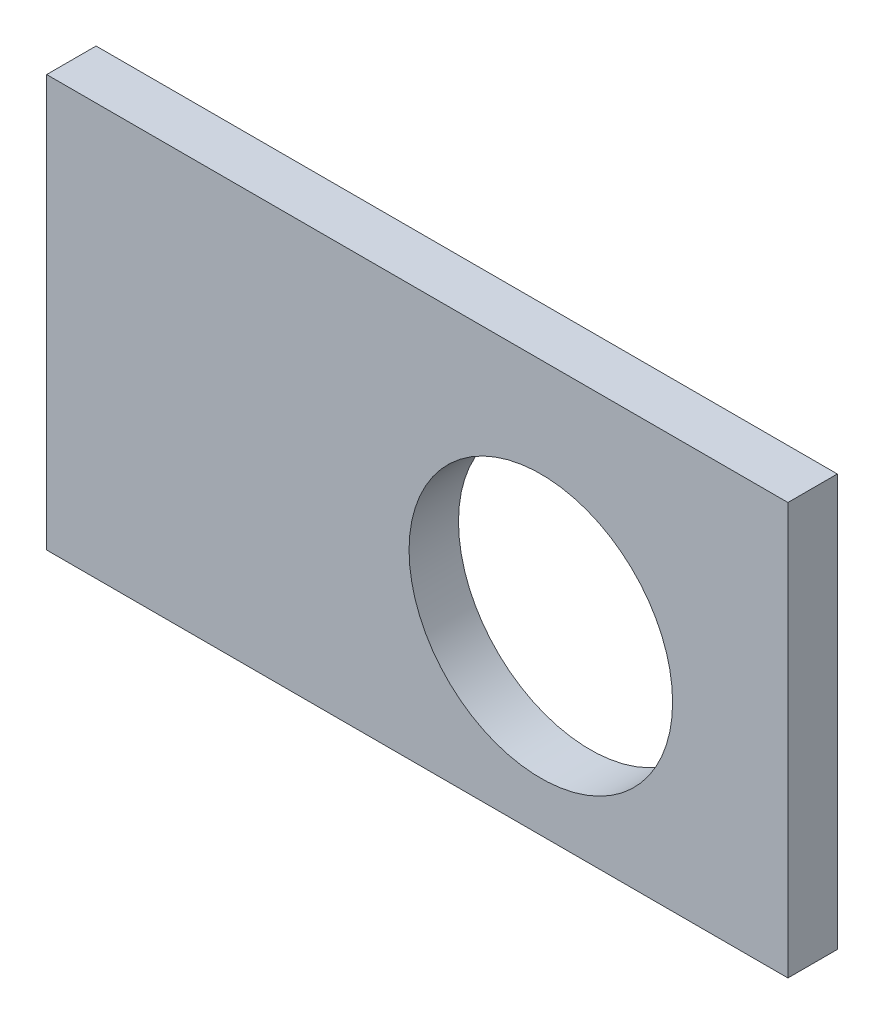
ISO-10303-21;
HEADER;
FILE_DESCRIPTION(('STEP AP214'),'2;1');
FILE_NAME('part.step','',(''),(''),'','','');
FILE_SCHEMA(('AUTOMOTIVE_DESIGN { 1 0 10303 214 1 1 1 1 }'));
ENDSEC;
DATA;
#1=APPLICATION_CONTEXT('core data for automotive mechanical design processes');
#2=APPLICATION_PROTOCOL_DEFINITION('international standard','automotive_design',2000,#1);
#3=PRODUCT_CONTEXT('',#1,'mechanical');
#4=PRODUCT('Part','Part','',(#3));
#5=PRODUCT_RELATED_PRODUCT_CATEGORY('part','',(#4));
#6=PRODUCT_DEFINITION_FORMATION('','',#4);
#7=PRODUCT_DEFINITION_CONTEXT('part definition',#1,'design');
#8=PRODUCT_DEFINITION('design','',#6,#7);
#9=PRODUCT_DEFINITION_SHAPE('','',#8);
#10=(LENGTH_UNIT() NAMED_UNIT(*) SI_UNIT(.MILLI.,.METRE.));
#11=(NAMED_UNIT(*) PLANE_ANGLE_UNIT() SI_UNIT($,.RADIAN.));
#12=(NAMED_UNIT(*) SI_UNIT($,.STERADIAN.) SOLID_ANGLE_UNIT());
#13=UNCERTAINTY_MEASURE_WITH_UNIT(LENGTH_MEASURE(1.E-05),#10,'distance_accuracy_value','');
#14=(GEOMETRIC_REPRESENTATION_CONTEXT(3) GLOBAL_UNCERTAINTY_ASSIGNED_CONTEXT((#13)) GLOBAL_UNIT_ASSIGNED_CONTEXT((#10,
#11,#12)) REPRESENTATION_CONTEXT('',''));
#15=CARTESIAN_POINT('',(0.,0.,0.));
#16=DIRECTION('',(0.,0.,1.));
#17=DIRECTION('',(1.,0.,0.));
#18=AXIS2_PLACEMENT_3D('',#15,#16,#17);
#19=CARTESIAN_POINT('',(0.,0.,6.));
#20=DIRECTION('',(0.,0.,-1.));
#21=DIRECTION('',(-1.,0.,0.));
#22=AXIS2_PLACEMENT_3D('',#19,#20,#21);
#23=PLANE('',#22);
#24=DIRECTION('',(0.,-1.,0.));
#25=VECTOR('',#24,1.);
#26=CARTESIAN_POINT('',(0.,0.,6.));
#27=LINE('',#26,#25);
#28=CARTESIAN_POINT('',(0.,50.,6.));
#29=VERTEX_POINT('',#28);
#30=CARTESIAN_POINT('',(0.,0.,6.));
#31=VERTEX_POINT('',#30);
#32=EDGE_CURVE('E86',#29,#31,#27,.T.);
#33=ORIENTED_EDGE('',*,*,#32,.T.);
#34=DIRECTION('',(1.,0.,0.));
#35=VECTOR('',#34,1.);
#36=CARTESIAN_POINT('',(0.,0.,6.));
#37=LINE('',#36,#35);
#38=CARTESIAN_POINT('',(90.,0.,6.));
#39=VERTEX_POINT('',#38);
#40=EDGE_CURVE('E81',#31,#39,#37,.T.);
#41=ORIENTED_EDGE('',*,*,#40,.T.);
#42=DIRECTION('',(0.,1.,0.));
#43=VECTOR('',#42,1.);
#44=CARTESIAN_POINT('',(90.,0.,6.));
#45=LINE('',#44,#43);
#46=CARTESIAN_POINT('',(90.,50.,6.));
#47=VERTEX_POINT('',#46);
#48=EDGE_CURVE('E84',#39,#47,#45,.T.);
#49=ORIENTED_EDGE('',*,*,#48,.T.);
#50=DIRECTION('',(-1.,0.,0.));
#51=VECTOR('',#50,1.);
#52=CARTESIAN_POINT('',(0.,50.,6.));
#53=LINE('',#52,#51);
#54=EDGE_CURVE('E51',#47,#29,#53,.T.);
#55=ORIENTED_EDGE('',*,*,#54,.T.);
#56=EDGE_LOOP('',(#33,#41,#49,#55));
#57=FACE_BOUND('',#56,.T.);
#58=CARTESIAN_POINT('',(60.,22.,6.));
#59=DIRECTION('',(0.,0.,1.));
#60=DIRECTION('',(1.,0.,0.));
#61=AXIS2_PLACEMENT_3D('',#58,#59,#60);
#62=CIRCLE('',#61,16.);
#63=CARTESIAN_POINT('',(76.,22.,6.));
#64=VERTEX_POINT('',#63);
#65=EDGE_CURVE('E101',#64,#64,#62,.T.);
#66=ORIENTED_EDGE('',*,*,#65,.F.);
#67=EDGE_LOOP('',(#66));
#68=FACE_BOUND('',#67,.T.);
#69=ADVANCED_FACE('F34',(#57,#68),#23,.F.);
#70=CARTESIAN_POINT('',(0.,0.,0.));
#71=DIRECTION('',(0.,0.,-1.));
#72=DIRECTION('',(-1.,0.,0.));
#73=AXIS2_PLACEMENT_3D('',#70,#71,#72);
#74=PLANE('',#73);
#75=DIRECTION('',(0.,-1.,0.));
#76=VECTOR('',#75,1.);
#77=CARTESIAN_POINT('',(0.,0.,0.));
#78=LINE('',#77,#76);
#79=CARTESIAN_POINT('',(0.,50.,0.));
#80=VERTEX_POINT('',#79);
#81=CARTESIAN_POINT('',(0.,0.,0.));
#82=VERTEX_POINT('',#81);
#83=EDGE_CURVE('E98',#80,#82,#78,.T.);
#84=ORIENTED_EDGE('',*,*,#83,.F.);
#85=DIRECTION('',(-1.,0.,0.));
#86=VECTOR('',#85,1.);
#87=CARTESIAN_POINT('',(0.,50.,0.));
#88=LINE('',#87,#86);
#89=CARTESIAN_POINT('',(90.,50.,0.));
#90=VERTEX_POINT('',#89);
#91=EDGE_CURVE('E74',#90,#80,#88,.T.);
#92=ORIENTED_EDGE('',*,*,#91,.F.);
#93=DIRECTION('',(0.,1.,0.));
#94=VECTOR('',#93,1.);
#95=CARTESIAN_POINT('',(90.,0.,0.));
#96=LINE('',#95,#94);
#97=CARTESIAN_POINT('',(90.,0.,0.));
#98=VERTEX_POINT('',#97);
#99=EDGE_CURVE('E68',#98,#90,#96,.T.);
#100=ORIENTED_EDGE('',*,*,#99,.F.);
#101=DIRECTION('',(1.,0.,0.));
#102=VECTOR('',#101,1.);
#103=CARTESIAN_POINT('',(0.,0.,0.));
#104=LINE('',#103,#102);
#105=EDGE_CURVE('E90',#82,#98,#104,.T.);
#106=ORIENTED_EDGE('',*,*,#105,.F.);
#107=EDGE_LOOP('',(#84,#92,#100,#106));
#108=FACE_BOUND('',#107,.T.);
#109=CARTESIAN_POINT('',(60.,22.,0.));
#110=DIRECTION('',(0.,0.,1.));
#111=DIRECTION('',(1.,0.,0.));
#112=AXIS2_PLACEMENT_3D('',#109,#110,#111);
#113=CIRCLE('',#112,16.);
#114=CARTESIAN_POINT('',(76.,22.,0.));
#115=VERTEX_POINT('',#114);
#116=EDGE_CURVE('E113',#115,#115,#113,.T.);
#117=ORIENTED_EDGE('',*,*,#116,.T.);
#118=EDGE_LOOP('',(#117));
#119=FACE_BOUND('',#118,.T.);
#120=ADVANCED_FACE('F109',(#108,#119),#74,.T.);
#121=CARTESIAN_POINT('',(0.,0.,6.));
#122=DIRECTION('',(1.,0.,0.));
#123=DIRECTION('',(0.,0.,-1.));
#124=AXIS2_PLACEMENT_3D('',#121,#122,#123);
#125=PLANE('',#124);
#126=ORIENTED_EDGE('',*,*,#83,.T.);
#127=DIRECTION('',(0.,0.,-1.));
#128=VECTOR('',#127,1.);
#129=CARTESIAN_POINT('',(0.,0.,6.));
#130=LINE('',#129,#128);
#131=EDGE_CURVE('E11',#31,#82,#130,.T.);
#132=ORIENTED_EDGE('',*,*,#131,.F.);
#133=ORIENTED_EDGE('',*,*,#32,.F.);
#134=DIRECTION('',(0.,0.,-1.));
#135=VECTOR('',#134,1.);
#136=CARTESIAN_POINT('',(0.,50.,6.));
#137=LINE('',#136,#135);
#138=EDGE_CURVE('E94',#29,#80,#137,.T.);
#139=ORIENTED_EDGE('',*,*,#138,.T.);
#140=EDGE_LOOP('',(#126,#132,#133,#139));
#141=FACE_BOUND('',#140,.T.);
#142=ADVANCED_FACE('F36',(#141),#125,.F.);
#143=CARTESIAN_POINT('',(0.,0.,6.));
#144=DIRECTION('',(0.,1.,0.));
#145=DIRECTION('',(0.,0.,1.));
#146=AXIS2_PLACEMENT_3D('',#143,#144,#145);
#147=PLANE('',#146);
#148=ORIENTED_EDGE('',*,*,#105,.T.);
#149=DIRECTION('',(0.,0.,-1.));
#150=VECTOR('',#149,1.);
#151=CARTESIAN_POINT('',(90.,0.,6.));
#152=LINE('',#151,#150);
#153=EDGE_CURVE('E43',#39,#98,#152,.T.);
#154=ORIENTED_EDGE('',*,*,#153,.F.);
#155=ORIENTED_EDGE('',*,*,#40,.F.);
#156=ORIENTED_EDGE('',*,*,#131,.T.);
#157=EDGE_LOOP('',(#148,#154,#155,#156));
#158=FACE_BOUND('',#157,.T.);
#159=ADVANCED_FACE('F89',(#158),#147,.F.);
#160=CARTESIAN_POINT('',(90.,0.,6.));
#161=DIRECTION('',(-1.,0.,0.));
#162=DIRECTION('',(0.,0.,1.));
#163=AXIS2_PLACEMENT_3D('',#160,#161,#162);
#164=PLANE('',#163);
#165=ORIENTED_EDGE('',*,*,#99,.T.);
#166=DIRECTION('',(0.,0.,-1.));
#167=VECTOR('',#166,1.);
#168=CARTESIAN_POINT('',(90.,50.,6.));
#169=LINE('',#168,#167);
#170=EDGE_CURVE('E91',#47,#90,#169,.T.);
#171=ORIENTED_EDGE('',*,*,#170,.F.);
#172=ORIENTED_EDGE('',*,*,#48,.F.);
#173=ORIENTED_EDGE('',*,*,#153,.T.);
#174=EDGE_LOOP('',(#165,#171,#172,#173));
#175=FACE_BOUND('',#174,.T.);
#176=ADVANCED_FACE('F92',(#175),#164,.F.);
#177=CARTESIAN_POINT('',(0.,50.,6.));
#178=DIRECTION('',(0.,-1.,0.));
#179=DIRECTION('',(0.,0.,-1.));
#180=AXIS2_PLACEMENT_3D('',#177,#178,#179);
#181=PLANE('',#180);
#182=ORIENTED_EDGE('',*,*,#91,.T.);
#183=ORIENTED_EDGE('',*,*,#138,.F.);
#184=ORIENTED_EDGE('',*,*,#54,.F.);
#185=ORIENTED_EDGE('',*,*,#170,.T.);
#186=EDGE_LOOP('',(#182,#183,#184,#185));
#187=FACE_BOUND('',#186,.T.);
#188=ADVANCED_FACE('F106',(#187),#181,.F.);
#189=CARTESIAN_POINT('',(60.,22.,6.));
#190=DIRECTION('',(0.,0.,-1.));
#191=DIRECTION('',(-1.,0.,0.));
#192=AXIS2_PLACEMENT_3D('',#189,#190,#191);
#193=CYLINDRICAL_SURFACE('',#192,16.);
#194=ORIENTED_EDGE('',*,*,#65,.T.);
#195=EDGE_LOOP('',(#194));
#196=FACE_BOUND('',#195,.T.);
#197=ORIENTED_EDGE('',*,*,#116,.F.);
#198=EDGE_LOOP('',(#197));
#199=FACE_BOUND('',#198,.T.);
#200=ADVANCED_FACE('F119',(#196,#199),#193,.F.);
#201=CLOSED_SHELL('',(#69,#120,#142,#159,#176,#188,#200));
#202=MANIFOLD_SOLID_BREP('B2',#201);
#203=ADVANCED_BREP_SHAPE_REPRESENTATION('',(#18,#202),#14);
#204=SHAPE_DEFINITION_REPRESENTATION(#9,#203);
ENDSEC;
END-ISO-10303-21;
